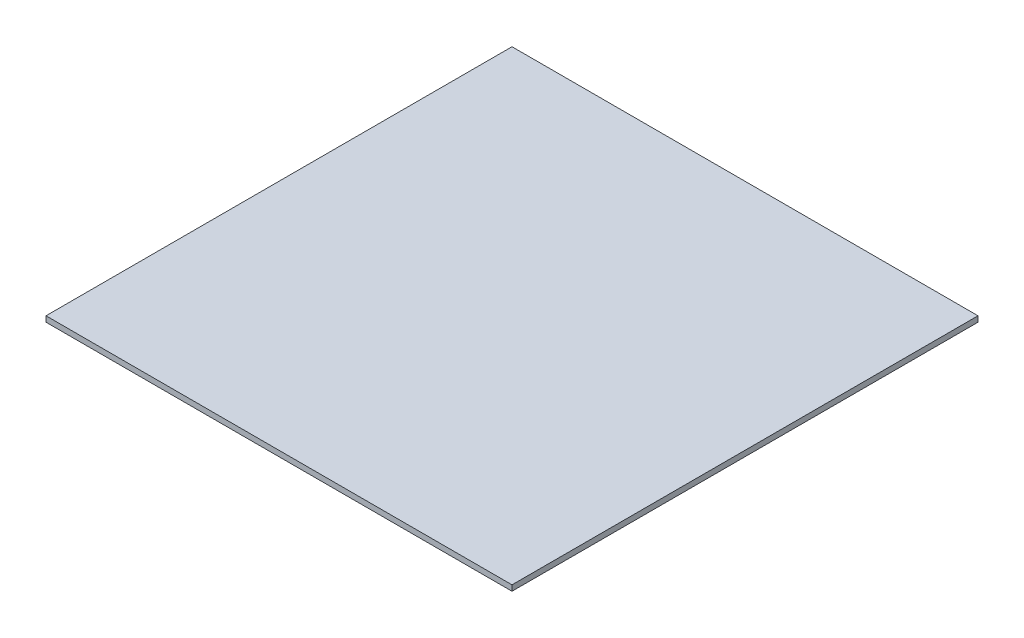
ISO-10303-21;
HEADER;
FILE_DESCRIPTION(('STEP AP214'),'2;1');
FILE_NAME('part.step','',(''),(''),'','','');
FILE_SCHEMA(('AUTOMOTIVE_DESIGN { 1 0 10303 214 1 1 1 1 }'));
ENDSEC;
DATA;
#1=APPLICATION_CONTEXT('core data for automotive mechanical design processes');
#2=APPLICATION_PROTOCOL_DEFINITION('international standard','automotive_design',2000,#1);
#3=PRODUCT_CONTEXT('',#1,'mechanical');
#4=PRODUCT('Part','Part','',(#3));
#5=PRODUCT_RELATED_PRODUCT_CATEGORY('part','',(#4));
#6=PRODUCT_DEFINITION_FORMATION('','',#4);
#7=PRODUCT_DEFINITION_CONTEXT('part definition',#1,'design');
#8=PRODUCT_DEFINITION('design','',#6,#7);
#9=PRODUCT_DEFINITION_SHAPE('','',#8);
#10=(LENGTH_UNIT() NAMED_UNIT(*) SI_UNIT(.MILLI.,.METRE.));
#11=(NAMED_UNIT(*) PLANE_ANGLE_UNIT() SI_UNIT($,.RADIAN.));
#12=(NAMED_UNIT(*) SI_UNIT($,.STERADIAN.) SOLID_ANGLE_UNIT());
#13=UNCERTAINTY_MEASURE_WITH_UNIT(LENGTH_MEASURE(1.E-05),#10,'distance_accuracy_value','');
#14=(GEOMETRIC_REPRESENTATION_CONTEXT(3) GLOBAL_UNCERTAINTY_ASSIGNED_CONTEXT((#13)) GLOBAL_UNIT_ASSIGNED_CONTEXT((#10,
#11,#12)) REPRESENTATION_CONTEXT('',''));
#15=CARTESIAN_POINT('',(0.,0.,0.));
#16=DIRECTION('',(0.,0.,1.));
#17=DIRECTION('',(1.,0.,0.));
#18=AXIS2_PLACEMENT_3D('',#15,#16,#17);
#19=CARTESIAN_POINT('',(495.3,11.90625,495.3));
#20=DIRECTION('',(-1.,0.,0.));
#21=DIRECTION('',(0.,0.,1.));
#22=AXIS2_PLACEMENT_3D('',#19,#20,#21);
#23=PLANE('',#22);
#24=DIRECTION('',(0.,0.,-1.));
#25=VECTOR('',#24,1.);
#26=CARTESIAN_POINT('',(495.3,0.,495.3));
#27=LINE('',#26,#25);
#28=CARTESIAN_POINT('',(495.3,0.,495.3));
#29=VERTEX_POINT('',#28);
#30=CARTESIAN_POINT('',(495.3,0.,-495.3));
#31=VERTEX_POINT('',#30);
#32=EDGE_CURVE('E97',#29,#31,#27,.T.);
#33=ORIENTED_EDGE('',*,*,#32,.T.);
#34=DIRECTION('',(0.,-1.,0.));
#35=VECTOR('',#34,1.);
#36=CARTESIAN_POINT('',(495.3,11.90625,-495.3));
#37=LINE('',#36,#35);
#38=CARTESIAN_POINT('',(495.3,11.90625,-495.3));
#39=VERTEX_POINT('',#38);
#40=EDGE_CURVE('E11',#39,#31,#37,.T.);
#41=ORIENTED_EDGE('',*,*,#40,.F.);
#42=DIRECTION('',(0.,0.,-1.));
#43=VECTOR('',#42,1.);
#44=CARTESIAN_POINT('',(495.3,11.90625,495.3));
#45=LINE('',#44,#43);
#46=CARTESIAN_POINT('',(495.3,11.90625,495.3));
#47=VERTEX_POINT('',#46);
#48=EDGE_CURVE('E85',#47,#39,#45,.T.);
#49=ORIENTED_EDGE('',*,*,#48,.F.);
#50=DIRECTION('',(0.,-1.,0.));
#51=VECTOR('',#50,1.);
#52=CARTESIAN_POINT('',(495.3,11.90625,495.3));
#53=LINE('',#52,#51);
#54=EDGE_CURVE('E93',#47,#29,#53,.T.);
#55=ORIENTED_EDGE('',*,*,#54,.T.);
#56=EDGE_LOOP('',(#33,#41,#49,#55));
#57=FACE_BOUND('',#56,.T.);
#58=ADVANCED_FACE('F34',(#57),#23,.F.);
#59=CARTESIAN_POINT('',(-495.3,11.90625,-495.3));
#60=DIRECTION('',(0.,0.,1.));
#61=DIRECTION('',(1.,0.,0.));
#62=AXIS2_PLACEMENT_3D('',#59,#60,#61);
#63=PLANE('',#62);
#64=DIRECTION('',(-1.,0.,0.));
#65=VECTOR('',#64,1.);
#66=CARTESIAN_POINT('',(-495.3,0.,-495.3));
#67=LINE('',#66,#65);
#68=CARTESIAN_POINT('',(-495.3,0.,-495.3));
#69=VERTEX_POINT('',#68);
#70=EDGE_CURVE('E89',#31,#69,#67,.T.);
#71=ORIENTED_EDGE('',*,*,#70,.T.);
#72=DIRECTION('',(0.,-1.,0.));
#73=VECTOR('',#72,1.);
#74=CARTESIAN_POINT('',(-495.3,11.90625,-495.3));
#75=LINE('',#74,#73);
#76=CARTESIAN_POINT('',(-495.3,11.90625,-495.3));
#77=VERTEX_POINT('',#76);
#78=EDGE_CURVE('E42',#77,#69,#75,.T.);
#79=ORIENTED_EDGE('',*,*,#78,.F.);
#80=DIRECTION('',(-1.,0.,0.));
#81=VECTOR('',#80,1.);
#82=CARTESIAN_POINT('',(-495.3,11.90625,-495.3));
#83=LINE('',#82,#81);
#84=EDGE_CURVE('E80',#39,#77,#83,.T.);
#85=ORIENTED_EDGE('',*,*,#84,.F.);
#86=ORIENTED_EDGE('',*,*,#40,.T.);
#87=EDGE_LOOP('',(#71,#79,#85,#86));
#88=FACE_BOUND('',#87,.T.);
#89=ADVANCED_FACE('F88',(#88),#63,.F.);
#90=CARTESIAN_POINT('',(-495.3,11.90625,495.3));
#91=DIRECTION('',(1.,0.,0.));
#92=DIRECTION('',(0.,0.,-1.));
#93=AXIS2_PLACEMENT_3D('',#90,#91,#92);
#94=PLANE('',#93);
#95=DIRECTION('',(0.,0.,1.));
#96=VECTOR('',#95,1.);
#97=CARTESIAN_POINT('',(-495.3,0.,495.3));
#98=LINE('',#97,#96);
#99=CARTESIAN_POINT('',(-495.3,0.,495.3));
#100=VERTEX_POINT('',#99);
#101=EDGE_CURVE('E67',#69,#100,#98,.T.);
#102=ORIENTED_EDGE('',*,*,#101,.T.);
#103=DIRECTION('',(0.,-1.,0.));
#104=VECTOR('',#103,1.);
#105=CARTESIAN_POINT('',(-495.3,11.90625,495.3));
#106=LINE('',#105,#104);
#107=CARTESIAN_POINT('',(-495.3,11.90625,495.3));
#108=VERTEX_POINT('',#107);
#109=EDGE_CURVE('E90',#108,#100,#106,.T.);
#110=ORIENTED_EDGE('',*,*,#109,.F.);
#111=DIRECTION('',(0.,0.,1.));
#112=VECTOR('',#111,1.);
#113=CARTESIAN_POINT('',(-495.3,11.90625,495.3));
#114=LINE('',#113,#112);
#115=EDGE_CURVE('E83',#77,#108,#114,.T.);
#116=ORIENTED_EDGE('',*,*,#115,.F.);
#117=ORIENTED_EDGE('',*,*,#78,.T.);
#118=EDGE_LOOP('',(#102,#110,#116,#117));
#119=FACE_BOUND('',#118,.T.);
#120=ADVANCED_FACE('F91',(#119),#94,.F.);
#121=CARTESIAN_POINT('',(-495.3,11.90625,495.3));
#122=DIRECTION('',(0.,0.,-1.));
#123=DIRECTION('',(-1.,0.,0.));
#124=AXIS2_PLACEMENT_3D('',#121,#122,#123);
#125=PLANE('',#124);
#126=DIRECTION('',(1.,0.,0.));
#127=VECTOR('',#126,1.);
#128=CARTESIAN_POINT('',(-495.3,0.,495.3));
#129=LINE('',#128,#127);
#130=EDGE_CURVE('E73',#100,#29,#129,.T.);
#131=ORIENTED_EDGE('',*,*,#130,.T.);
#132=ORIENTED_EDGE('',*,*,#54,.F.);
#133=DIRECTION('',(1.,0.,0.));
#134=VECTOR('',#133,1.);
#135=CARTESIAN_POINT('',(-495.3,11.90625,495.3));
#136=LINE('',#135,#134);
#137=EDGE_CURVE('E50',#108,#47,#136,.T.);
#138=ORIENTED_EDGE('',*,*,#137,.F.);
#139=ORIENTED_EDGE('',*,*,#109,.T.);
#140=EDGE_LOOP('',(#131,#132,#138,#139));
#141=FACE_BOUND('',#140,.T.);
#142=ADVANCED_FACE('F104',(#141),#125,.F.);
#143=CARTESIAN_POINT('',(0.,11.90625,0.));
#144=DIRECTION('',(0.,-1.,0.));
#145=DIRECTION('',(0.,0.,-1.));
#146=AXIS2_PLACEMENT_3D('',#143,#144,#145);
#147=PLANE('',#146);
#148=ORIENTED_EDGE('',*,*,#48,.T.);
#149=ORIENTED_EDGE('',*,*,#84,.T.);
#150=ORIENTED_EDGE('',*,*,#115,.T.);
#151=ORIENTED_EDGE('',*,*,#137,.T.);
#152=EDGE_LOOP('',(#148,#149,#150,#151));
#153=FACE_BOUND('',#152,.T.);
#154=ADVANCED_FACE('F81',(#153),#147,.F.);
#155=CARTESIAN_POINT('',(0.,0.,0.));
#156=DIRECTION('',(0.,-1.,0.));
#157=DIRECTION('',(0.,0.,-1.));
#158=AXIS2_PLACEMENT_3D('',#155,#156,#157);
#159=PLANE('',#158);
#160=ORIENTED_EDGE('',*,*,#32,.F.);
#161=ORIENTED_EDGE('',*,*,#130,.F.);
#162=ORIENTED_EDGE('',*,*,#101,.F.);
#163=ORIENTED_EDGE('',*,*,#70,.F.);
#164=EDGE_LOOP('',(#160,#161,#162,#163));
#165=FACE_BOUND('',#164,.T.);
#166=ADVANCED_FACE('F107',(#165),#159,.T.);
#167=CLOSED_SHELL('',(#58,#89,#120,#142,#154,#166));
#168=MANIFOLD_SOLID_BREP('B2',#167);
#169=ADVANCED_BREP_SHAPE_REPRESENTATION('',(#18,#168),#14);
#170=SHAPE_DEFINITION_REPRESENTATION(#9,#169);
ENDSEC;
END-ISO-10303-21;
